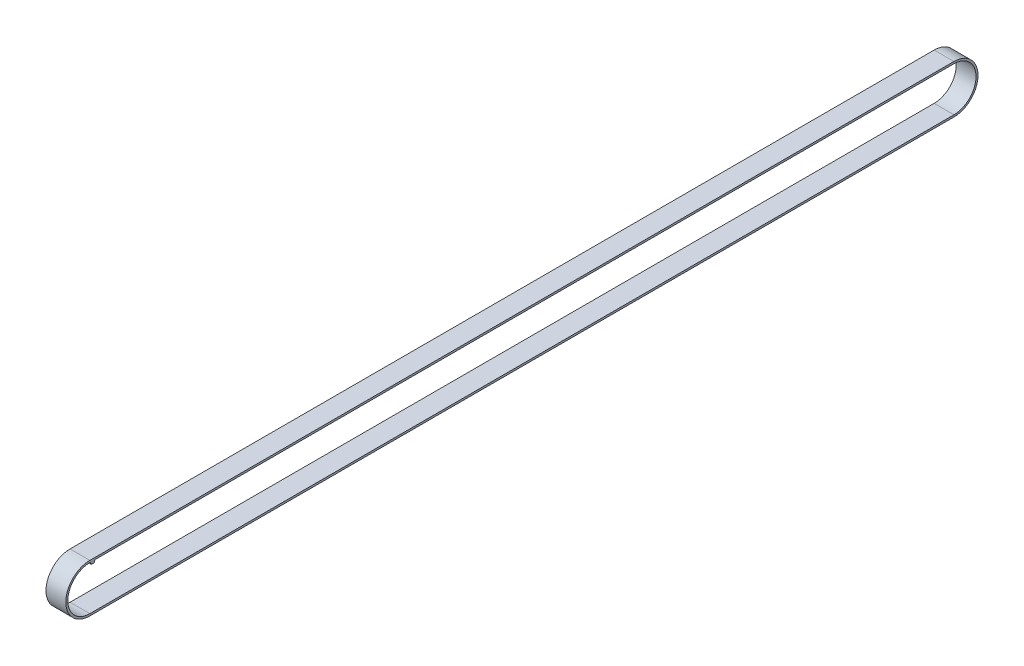
ISO-10303-21;
HEADER;
FILE_DESCRIPTION(('STEP AP214'),'2;1');
FILE_NAME('part.step','',(''),(''),'','','');
FILE_SCHEMA(('AUTOMOTIVE_DESIGN { 1 0 10303 214 1 1 1 1 }'));
ENDSEC;
DATA;
#1=APPLICATION_CONTEXT('core data for automotive mechanical design processes');
#2=APPLICATION_PROTOCOL_DEFINITION('international standard','automotive_design',2000,#1);
#3=PRODUCT_CONTEXT('',#1,'mechanical');
#4=PRODUCT('Part','Part','',(#3));
#5=PRODUCT_RELATED_PRODUCT_CATEGORY('part','',(#4));
#6=PRODUCT_DEFINITION_FORMATION('','',#4);
#7=PRODUCT_DEFINITION_CONTEXT('part definition',#1,'design');
#8=PRODUCT_DEFINITION('design','',#6,#7);
#9=PRODUCT_DEFINITION_SHAPE('','',#8);
#10=(LENGTH_UNIT() NAMED_UNIT(*) SI_UNIT(.MILLI.,.METRE.));
#11=(NAMED_UNIT(*) PLANE_ANGLE_UNIT() SI_UNIT($,.RADIAN.));
#12=(NAMED_UNIT(*) SI_UNIT($,.STERADIAN.) SOLID_ANGLE_UNIT());
#13=UNCERTAINTY_MEASURE_WITH_UNIT(LENGTH_MEASURE(1.E-05),#10,'distance_accuracy_value','');
#14=(GEOMETRIC_REPRESENTATION_CONTEXT(3) GLOBAL_UNCERTAINTY_ASSIGNED_CONTEXT((#13)) GLOBAL_UNIT_ASSIGNED_CONTEXT((#10,
#11,#12)) REPRESENTATION_CONTEXT('',''));
#15=CARTESIAN_POINT('',(0.,0.,0.));
#16=DIRECTION('',(0.,0.,1.));
#17=DIRECTION('',(1.,0.,0.));
#18=AXIS2_PLACEMENT_3D('',#15,#16,#17);
#19=CARTESIAN_POINT('',(6.,6.7,0.));
#20=DIRECTION('',(0.,-1.,0.));
#21=DIRECTION('',(0.,0.,-1.));
#22=AXIS2_PLACEMENT_3D('',#19,#20,#21);
#23=PLANE('',#22);
#24=DIRECTION('',(0.,0.,1.));
#25=VECTOR('',#24,1.);
#26=CARTESIAN_POINT('',(6.,6.7,0.));
#27=LINE('',#26,#25);
#28=CARTESIAN_POINT('',(6.,6.7,-262.));
#29=VERTEX_POINT('',#28);
#30=CARTESIAN_POINT('',(6.,6.7,-1.69384731022608));
#31=VERTEX_POINT('',#30);
#32=EDGE_CURVE('E185',#29,#31,#27,.T.);
#33=ORIENTED_EDGE('',*,*,#32,.T.);
#34=DIRECTION('',(-1.,0.,0.));
#35=VECTOR('',#34,1.);
#36=CARTESIAN_POINT('',(6.,6.7,-1.69384731022608));
#37=LINE('',#36,#35);
#38=CARTESIAN_POINT('',(0.,6.7,-1.69384731022608));
#39=VERTEX_POINT('',#38);
#40=EDGE_CURVE('E423',#31,#39,#37,.T.);
#41=ORIENTED_EDGE('',*,*,#40,.T.);
#42=DIRECTION('',(0.,0.,1.));
#43=VECTOR('',#42,1.);
#44=CARTESIAN_POINT('',(0.,6.7,0.));
#45=LINE('',#44,#43);
#46=CARTESIAN_POINT('',(0.,6.7,-262.));
#47=VERTEX_POINT('',#46);
#48=EDGE_CURVE('E181',#47,#39,#45,.T.);
#49=ORIENTED_EDGE('',*,*,#48,.F.);
#50=DIRECTION('',(-1.,0.,0.));
#51=VECTOR('',#50,1.);
#52=CARTESIAN_POINT('',(6.,6.7,-262.));
#53=LINE('',#52,#51);
#54=EDGE_CURVE('E50',#29,#47,#53,.T.);
#55=ORIENTED_EDGE('',*,*,#54,.F.);
#56=EDGE_LOOP('',(#33,#41,#49,#55));
#57=FACE_BOUND('',#56,.T.);
#58=ADVANCED_FACE('F35',(#57),#23,.T.);
#59=CARTESIAN_POINT('',(6.,0.,0.));
#60=DIRECTION('',(1.,0.,0.));
#61=DIRECTION('',(0.,0.,-1.));
#62=AXIS2_PLACEMENT_3D('',#59,#60,#61);
#63=PLANE('',#62);
#64=CARTESIAN_POINT('',(6.,0.,0.));
#65=DIRECTION('',(1.,0.,0.));
#66=DIRECTION('',(0.,0.,-1.));
#67=AXIS2_PLACEMENT_3D('',#64,#65,#66);
#68=CIRCLE('',#67,7.3);
#69=CARTESIAN_POINT('',(6.,7.3,0.));
#70=VERTEX_POINT('',#69);
#71=CARTESIAN_POINT('',(6.,-7.3,0.));
#72=VERTEX_POINT('',#71);
#73=EDGE_CURVE('E203',#70,#72,#68,.T.);
#74=ORIENTED_EDGE('',*,*,#73,.T.);
#75=DIRECTION('',(0.,0.,-1.));
#76=VECTOR('',#75,1.);
#77=CARTESIAN_POINT('',(6.,-7.3,0.));
#78=LINE('',#77,#76);
#79=CARTESIAN_POINT('',(6.,-7.3,-262.));
#80=VERTEX_POINT('',#79);
#81=EDGE_CURVE('E206',#72,#80,#78,.T.);
#82=ORIENTED_EDGE('',*,*,#81,.T.);
#83=CARTESIAN_POINT('',(6.,0.,-262.));
#84=DIRECTION('',(1.,0.,0.));
#85=DIRECTION('',(0.,0.,-1.));
#86=AXIS2_PLACEMENT_3D('',#83,#84,#85);
#87=CIRCLE('',#86,7.3);
#88=CARTESIAN_POINT('',(6.,7.3,-262.));
#89=VERTEX_POINT('',#88);
#90=EDGE_CURVE('E209',#80,#89,#87,.T.);
#91=ORIENTED_EDGE('',*,*,#90,.T.);
#92=DIRECTION('',(0.,0.,1.));
#93=VECTOR('',#92,1.);
#94=CARTESIAN_POINT('',(6.,7.3,0.));
#95=LINE('',#94,#93);
#96=EDGE_CURVE('E211',#89,#70,#95,.T.);
#97=ORIENTED_EDGE('',*,*,#96,.T.);
#98=EDGE_LOOP('',(#74,#82,#91,#97));
#99=FACE_BOUND('',#98,.T.);
#100=DIRECTION('',(0.,0.,-1.));
#101=VECTOR('',#100,1.);
#102=CARTESIAN_POINT('',(6.,-6.7,0.));
#103=LINE('',#102,#101);
#104=CARTESIAN_POINT('',(6.,-6.7,0.));
#105=VERTEX_POINT('',#104);
#106=CARTESIAN_POINT('',(6.,-6.7,-262.));
#107=VERTEX_POINT('',#106);
#108=EDGE_CURVE('E180',#105,#107,#103,.T.);
#109=ORIENTED_EDGE('',*,*,#108,.F.);
#110=CARTESIAN_POINT('',(6.,0.,0.));
#111=DIRECTION('',(1.,0.,0.));
#112=DIRECTION('',(0.,0.,-1.));
#113=AXIS2_PLACEMENT_3D('',#110,#111,#112);
#114=CIRCLE('',#113,6.7);
#115=CARTESIAN_POINT('',(6.,6.7,0.));
#116=VERTEX_POINT('',#115);
#117=EDGE_CURVE('E178',#116,#105,#114,.T.);
#118=ORIENTED_EDGE('',*,*,#117,.F.);
#119=CARTESIAN_POINT('',(6.,6.5,0.));
#120=DIRECTION('',(-1.,0.,0.));
#121=DIRECTION('',(0.,0.,-1.));
#122=AXIS2_PLACEMENT_3D('',#119,#120,#121);
#123=CIRCLE('',#122,0.200000000000001);
#124=CARTESIAN_POINT('',(6.,6.56840402866513,-0.187938524157182));
#125=VERTEX_POINT('',#124);
#126=EDGE_CURVE('E440',#116,#125,#123,.T.);
#127=ORIENTED_EDGE('',*,*,#126,.T.);
#128=DIRECTION('',(0.,-0.939692620785909,-0.342020143325667));
#129=VECTOR('',#128,1.);
#130=CARTESIAN_POINT('',(6.,6.56840402866513,-0.187938524157182));
#131=LINE('',#130,#129);
#132=CARTESIAN_POINT('',(6.,6.13159597133487,-0.346923655113042));
#133=VERTEX_POINT('',#132);
#134=EDGE_CURVE('E161',#125,#133,#131,.T.);
#135=ORIENTED_EDGE('',*,*,#134,.T.);
#136=CARTESIAN_POINT('',(6.,6.2,-0.534862179270224));
#137=DIRECTION('',(1.,0.,0.));
#138=DIRECTION('',(0.,0.,-1.));
#139=AXIS2_PLACEMENT_3D('',#136,#137,#138);
#140=CIRCLE('',#139,0.2);
#141=CARTESIAN_POINT('',(6.,6.,-0.534862179270224));
#142=VERTEX_POINT('',#141);
#143=EDGE_CURVE('E155',#133,#142,#140,.T.);
#144=ORIENTED_EDGE('',*,*,#143,.T.);
#145=DIRECTION('',(0.,0.,-1.));
#146=VECTOR('',#145,1.);
#147=CARTESIAN_POINT('',(6.,6.,-0.534862179270224));
#148=LINE('',#147,#146);
#149=CARTESIAN_POINT('',(6.,6.,-1.15898513095586));
#150=VERTEX_POINT('',#149);
#151=EDGE_CURVE('E144',#142,#150,#148,.T.);
#152=ORIENTED_EDGE('',*,*,#151,.T.);
#153=CARTESIAN_POINT('',(6.,6.2,-1.15898513095586));
#154=DIRECTION('',(1.,0.,0.));
#155=DIRECTION('',(0.,0.,-1.));
#156=AXIS2_PLACEMENT_3D('',#153,#154,#155);
#157=CIRCLE('',#156,0.2);
#158=CARTESIAN_POINT('',(6.,6.13159597133487,-1.34692365511304));
#159=VERTEX_POINT('',#158);
#160=EDGE_CURVE('E154',#150,#159,#157,.T.);
#161=ORIENTED_EDGE('',*,*,#160,.T.);
#162=DIRECTION('',(0.,0.939692620785909,-0.342020143325668));
#163=VECTOR('',#162,1.);
#164=CARTESIAN_POINT('',(6.,6.13159597133487,-1.34692365511304));
#165=LINE('',#164,#163);
#166=CARTESIAN_POINT('',(6.,6.56840402866513,-1.5059087860689));
#167=VERTEX_POINT('',#166);
#168=EDGE_CURVE('E433',#159,#167,#165,.T.);
#169=ORIENTED_EDGE('',*,*,#168,.T.);
#170=CARTESIAN_POINT('',(6.,6.5,-1.69384731022608));
#171=DIRECTION('',(-1.,0.,0.));
#172=DIRECTION('',(0.,0.,1.));
#173=AXIS2_PLACEMENT_3D('',#170,#171,#172);
#174=CIRCLE('',#173,0.200000000000001);
#175=EDGE_CURVE('E439',#167,#31,#174,.T.);
#176=ORIENTED_EDGE('',*,*,#175,.T.);
#177=ORIENTED_EDGE('',*,*,#32,.F.);
#178=CARTESIAN_POINT('',(6.,0.,-262.));
#179=DIRECTION('',(1.,0.,0.));
#180=DIRECTION('',(0.,0.,-1.));
#181=AXIS2_PLACEMENT_3D('',#178,#179,#180);
#182=CIRCLE('',#181,6.7);
#183=EDGE_CURVE('E183',#107,#29,#182,.T.);
#184=ORIENTED_EDGE('',*,*,#183,.F.);
#185=EDGE_LOOP('',(#109,#118,#127,#135,#144,#152,#161,#169,#176,#177,#184));
#186=FACE_BOUND('',#185,.T.);
#187=ADVANCED_FACE('F159',(#99,#186),#63,.T.);
#188=CARTESIAN_POINT('',(0.,0.,0.));
#189=DIRECTION('',(1.,0.,0.));
#190=DIRECTION('',(0.,0.,-1.));
#191=AXIS2_PLACEMENT_3D('',#188,#189,#190);
#192=PLANE('',#191);
#193=CARTESIAN_POINT('',(0.,0.,0.));
#194=DIRECTION('',(1.,0.,0.));
#195=DIRECTION('',(0.,0.,-1.));
#196=AXIS2_PLACEMENT_3D('',#193,#194,#195);
#197=CIRCLE('',#196,7.3);
#198=CARTESIAN_POINT('',(0.,7.3,0.));
#199=VERTEX_POINT('',#198);
#200=CARTESIAN_POINT('',(0.,-7.3,0.));
#201=VERTEX_POINT('',#200);
#202=EDGE_CURVE('E202',#199,#201,#197,.T.);
#203=ORIENTED_EDGE('',*,*,#202,.F.);
#204=DIRECTION('',(0.,0.,1.));
#205=VECTOR('',#204,1.);
#206=CARTESIAN_POINT('',(0.,7.3,0.));
#207=LINE('',#206,#205);
#208=CARTESIAN_POINT('',(0.,7.3,-262.));
#209=VERTEX_POINT('',#208);
#210=EDGE_CURVE('E207',#209,#199,#207,.T.);
#211=ORIENTED_EDGE('',*,*,#210,.F.);
#212=CARTESIAN_POINT('',(0.,0.,-262.));
#213=DIRECTION('',(1.,0.,0.));
#214=DIRECTION('',(0.,0.,-1.));
#215=AXIS2_PLACEMENT_3D('',#212,#213,#214);
#216=CIRCLE('',#215,7.3);
#217=CARTESIAN_POINT('',(0.,-7.3,-262.));
#218=VERTEX_POINT('',#217);
#219=EDGE_CURVE('E218',#218,#209,#216,.T.);
#220=ORIENTED_EDGE('',*,*,#219,.F.);
#221=DIRECTION('',(0.,0.,-1.));
#222=VECTOR('',#221,1.);
#223=CARTESIAN_POINT('',(0.,-7.3,0.));
#224=LINE('',#223,#222);
#225=EDGE_CURVE('E216',#201,#218,#224,.T.);
#226=ORIENTED_EDGE('',*,*,#225,.F.);
#227=EDGE_LOOP('',(#203,#211,#220,#226));
#228=FACE_BOUND('',#227,.T.);
#229=CARTESIAN_POINT('',(0.,0.,0.));
#230=DIRECTION('',(1.,0.,0.));
#231=DIRECTION('',(0.,0.,-1.));
#232=AXIS2_PLACEMENT_3D('',#229,#230,#231);
#233=CIRCLE('',#232,6.7);
#234=CARTESIAN_POINT('',(0.,6.7,0.));
#235=VERTEX_POINT('',#234);
#236=CARTESIAN_POINT('',(0.,-6.7,0.));
#237=VERTEX_POINT('',#236);
#238=EDGE_CURVE('E170',#235,#237,#233,.T.);
#239=ORIENTED_EDGE('',*,*,#238,.T.);
#240=DIRECTION('',(0.,0.,-1.));
#241=VECTOR('',#240,1.);
#242=CARTESIAN_POINT('',(0.,-6.7,0.));
#243=LINE('',#242,#241);
#244=CARTESIAN_POINT('',(0.,-6.7,-262.));
#245=VERTEX_POINT('',#244);
#246=EDGE_CURVE('E172',#237,#245,#243,.T.);
#247=ORIENTED_EDGE('',*,*,#246,.T.);
#248=CARTESIAN_POINT('',(0.,0.,-262.));
#249=DIRECTION('',(1.,0.,0.));
#250=DIRECTION('',(0.,0.,-1.));
#251=AXIS2_PLACEMENT_3D('',#248,#249,#250);
#252=CIRCLE('',#251,6.7);
#253=EDGE_CURVE('E190',#245,#47,#252,.T.);
#254=ORIENTED_EDGE('',*,*,#253,.T.);
#255=ORIENTED_EDGE('',*,*,#48,.T.);
#256=CARTESIAN_POINT('',(0.,6.5,-1.69384731022608));
#257=DIRECTION('',(-1.,0.,0.));
#258=DIRECTION('',(0.,0.,1.));
#259=AXIS2_PLACEMENT_3D('',#256,#257,#258);
#260=CIRCLE('',#259,0.200000000000001);
#261=CARTESIAN_POINT('',(0.,6.56840402866513,-1.5059087860689));
#262=VERTEX_POINT('',#261);
#263=EDGE_CURVE('E419',#262,#39,#260,.T.);
#264=ORIENTED_EDGE('',*,*,#263,.F.);
#265=DIRECTION('',(0.,0.939692620785909,-0.342020143325668));
#266=VECTOR('',#265,1.);
#267=CARTESIAN_POINT('',(0.,6.13159597133487,-1.34692365511304));
#268=LINE('',#267,#266);
#269=CARTESIAN_POINT('',(0.,6.13159597133487,-1.34692365511304));
#270=VERTEX_POINT('',#269);
#271=EDGE_CURVE('E417',#270,#262,#268,.T.);
#272=ORIENTED_EDGE('',*,*,#271,.F.);
#273=CARTESIAN_POINT('',(0.,6.2,-1.15898513095586));
#274=DIRECTION('',(1.,0.,0.));
#275=DIRECTION('',(0.,0.,-1.));
#276=AXIS2_PLACEMENT_3D('',#273,#274,#275);
#277=CIRCLE('',#276,0.2);
#278=CARTESIAN_POINT('',(0.,6.,-1.15898513095586));
#279=VERTEX_POINT('',#278);
#280=EDGE_CURVE('E411',#279,#270,#277,.T.);
#281=ORIENTED_EDGE('',*,*,#280,.F.);
#282=DIRECTION('',(0.,0.,-1.));
#283=VECTOR('',#282,1.);
#284=CARTESIAN_POINT('',(0.,6.,-0.534862179270224));
#285=LINE('',#284,#283);
#286=CARTESIAN_POINT('',(0.,6.,-0.534862179270224));
#287=VERTEX_POINT('',#286);
#288=EDGE_CURVE('E409',#287,#279,#285,.T.);
#289=ORIENTED_EDGE('',*,*,#288,.F.);
#290=CARTESIAN_POINT('',(0.,6.2,-0.534862179270224));
#291=DIRECTION('',(1.,0.,0.));
#292=DIRECTION('',(0.,0.,-1.));
#293=AXIS2_PLACEMENT_3D('',#290,#291,#292);
#294=CIRCLE('',#293,0.2);
#295=CARTESIAN_POINT('',(0.,6.13159597133487,-0.346923655113042));
#296=VERTEX_POINT('',#295);
#297=EDGE_CURVE('E169',#296,#287,#294,.T.);
#298=ORIENTED_EDGE('',*,*,#297,.F.);
#299=DIRECTION('',(0.,-0.939692620785909,-0.342020143325667));
#300=VECTOR('',#299,1.);
#301=CARTESIAN_POINT('',(0.,6.56840402866513,-0.187938524157182));
#302=LINE('',#301,#300);
#303=CARTESIAN_POINT('',(0.,6.56840402866513,-0.187938524157182));
#304=VERTEX_POINT('',#303);
#305=EDGE_CURVE('E165',#304,#296,#302,.T.);
#306=ORIENTED_EDGE('',*,*,#305,.F.);
#307=CARTESIAN_POINT('',(0.,6.5,0.));
#308=DIRECTION('',(-1.,0.,0.));
#309=DIRECTION('',(0.,0.,-1.));
#310=AXIS2_PLACEMENT_3D('',#307,#308,#309);
#311=CIRCLE('',#310,0.200000000000001);
#312=EDGE_CURVE('E58',#235,#304,#311,.T.);
#313=ORIENTED_EDGE('',*,*,#312,.F.);
#314=EDGE_LOOP('',(#239,#247,#254,#255,#264,#272,#281,#289,#298,#306,#313));
#315=FACE_BOUND('',#314,.T.);
#316=ADVANCED_FACE('F236',(#228,#315),#192,.F.);
#317=CARTESIAN_POINT('',(6.,0.,0.));
#318=DIRECTION('',(-1.,0.,0.));
#319=DIRECTION('',(0.,0.,1.));
#320=AXIS2_PLACEMENT_3D('',#317,#318,#319);
#321=CYLINDRICAL_SURFACE('',#320,7.3);
#322=ORIENTED_EDGE('',*,*,#202,.T.);
#323=DIRECTION('',(-1.,0.,0.));
#324=VECTOR('',#323,1.);
#325=CARTESIAN_POINT('',(6.,-7.3,0.));
#326=LINE('',#325,#324);
#327=EDGE_CURVE('E11',#72,#201,#326,.T.);
#328=ORIENTED_EDGE('',*,*,#327,.F.);
#329=ORIENTED_EDGE('',*,*,#73,.F.);
#330=DIRECTION('',(-1.,0.,0.));
#331=VECTOR('',#330,1.);
#332=CARTESIAN_POINT('',(6.,7.3,0.));
#333=LINE('',#332,#331);
#334=EDGE_CURVE('E213',#70,#199,#333,.T.);
#335=ORIENTED_EDGE('',*,*,#334,.T.);
#336=EDGE_LOOP('',(#322,#328,#329,#335));
#337=FACE_BOUND('',#336,.T.);
#338=ADVANCED_FACE('F37',(#337),#321,.T.);
#339=CARTESIAN_POINT('',(6.,-7.3,0.));
#340=DIRECTION('',(0.,1.,0.));
#341=DIRECTION('',(0.,0.,1.));
#342=AXIS2_PLACEMENT_3D('',#339,#340,#341);
#343=PLANE('',#342);
#344=ORIENTED_EDGE('',*,*,#225,.T.);
#345=DIRECTION('',(-1.,0.,0.));
#346=VECTOR('',#345,1.);
#347=CARTESIAN_POINT('',(6.,-7.3,-262.));
#348=LINE('',#347,#346);
#349=EDGE_CURVE('E43',#80,#218,#348,.T.);
#350=ORIENTED_EDGE('',*,*,#349,.F.);
#351=ORIENTED_EDGE('',*,*,#81,.F.);
#352=ORIENTED_EDGE('',*,*,#327,.T.);
#353=EDGE_LOOP('',(#344,#350,#351,#352));
#354=FACE_BOUND('',#353,.T.);
#355=ADVANCED_FACE('F245',(#354),#343,.F.);
#356=CARTESIAN_POINT('',(6.,0.,-262.));
#357=DIRECTION('',(-1.,0.,0.));
#358=DIRECTION('',(0.,0.,1.));
#359=AXIS2_PLACEMENT_3D('',#356,#357,#358);
#360=CYLINDRICAL_SURFACE('',#359,7.3);
#361=ORIENTED_EDGE('',*,*,#219,.T.);
#362=DIRECTION('',(-1.,0.,0.));
#363=VECTOR('',#362,1.);
#364=CARTESIAN_POINT('',(6.,7.3,-262.));
#365=LINE('',#364,#363);
#366=EDGE_CURVE('E223',#89,#209,#365,.T.);
#367=ORIENTED_EDGE('',*,*,#366,.F.);
#368=ORIENTED_EDGE('',*,*,#90,.F.);
#369=ORIENTED_EDGE('',*,*,#349,.T.);
#370=EDGE_LOOP('',(#361,#367,#368,#369));
#371=FACE_BOUND('',#370,.T.);
#372=ADVANCED_FACE('F230',(#371),#360,.T.);
#373=CARTESIAN_POINT('',(6.,7.3,0.));
#374=DIRECTION('',(0.,-1.,0.));
#375=DIRECTION('',(0.,0.,-1.));
#376=AXIS2_PLACEMENT_3D('',#373,#374,#375);
#377=PLANE('',#376);
#378=ORIENTED_EDGE('',*,*,#210,.T.);
#379=ORIENTED_EDGE('',*,*,#334,.F.);
#380=ORIENTED_EDGE('',*,*,#96,.F.);
#381=ORIENTED_EDGE('',*,*,#366,.T.);
#382=EDGE_LOOP('',(#378,#379,#380,#381));
#383=FACE_BOUND('',#382,.T.);
#384=ADVANCED_FACE('F239',(#383),#377,.F.);
#385=CARTESIAN_POINT('',(6.,0.,0.));
#386=DIRECTION('',(-1.,0.,0.));
#387=DIRECTION('',(0.,0.,1.));
#388=AXIS2_PLACEMENT_3D('',#385,#386,#387);
#389=CYLINDRICAL_SURFACE('',#388,6.7);
#390=ORIENTED_EDGE('',*,*,#238,.F.);
#391=DIRECTION('',(-1.,0.,0.));
#392=VECTOR('',#391,1.);
#393=CARTESIAN_POINT('',(6.,6.7,0.));
#394=LINE('',#393,#392);
#395=EDGE_CURVE('E186',#116,#235,#394,.T.);
#396=ORIENTED_EDGE('',*,*,#395,.F.);
#397=ORIENTED_EDGE('',*,*,#117,.T.);
#398=DIRECTION('',(-1.,0.,0.));
#399=VECTOR('',#398,1.);
#400=CARTESIAN_POINT('',(6.,-6.7,0.));
#401=LINE('',#400,#399);
#402=EDGE_CURVE('E199',#105,#237,#401,.T.);
#403=ORIENTED_EDGE('',*,*,#402,.T.);
#404=EDGE_LOOP('',(#390,#396,#397,#403));
#405=FACE_BOUND('',#404,.T.);
#406=ADVANCED_FACE('F268',(#405),#389,.F.);
#407=CARTESIAN_POINT('',(6.,-6.7,0.));
#408=DIRECTION('',(0.,1.,0.));
#409=DIRECTION('',(0.,0.,1.));
#410=AXIS2_PLACEMENT_3D('',#407,#408,#409);
#411=PLANE('',#410);
#412=ORIENTED_EDGE('',*,*,#246,.F.);
#413=ORIENTED_EDGE('',*,*,#402,.F.);
#414=ORIENTED_EDGE('',*,*,#108,.T.);
#415=DIRECTION('',(-1.,0.,0.));
#416=VECTOR('',#415,1.);
#417=CARTESIAN_POINT('',(6.,-6.7,-262.));
#418=LINE('',#417,#416);
#419=EDGE_CURVE('E197',#107,#245,#418,.T.);
#420=ORIENTED_EDGE('',*,*,#419,.T.);
#421=EDGE_LOOP('',(#412,#413,#414,#420));
#422=FACE_BOUND('',#421,.T.);
#423=ADVANCED_FACE('F264',(#422),#411,.T.);
#424=CARTESIAN_POINT('',(6.,0.,-262.));
#425=DIRECTION('',(-1.,0.,0.));
#426=DIRECTION('',(0.,0.,1.));
#427=AXIS2_PLACEMENT_3D('',#424,#425,#426);
#428=CYLINDRICAL_SURFACE('',#427,6.7);
#429=ORIENTED_EDGE('',*,*,#253,.F.);
#430=ORIENTED_EDGE('',*,*,#419,.F.);
#431=ORIENTED_EDGE('',*,*,#183,.T.);
#432=ORIENTED_EDGE('',*,*,#54,.T.);
#433=EDGE_LOOP('',(#429,#430,#431,#432));
#434=FACE_BOUND('',#433,.T.);
#435=ADVANCED_FACE('F261',(#434),#428,.F.);
#436=CARTESIAN_POINT('',(6.,6.2,-0.534862179270224));
#437=DIRECTION('',(-1.,0.,0.));
#438=DIRECTION('',(0.,0.,1.));
#439=AXIS2_PLACEMENT_3D('',#436,#437,#438);
#440=CYLINDRICAL_SURFACE('',#439,0.2);
#441=ORIENTED_EDGE('',*,*,#297,.T.);
#442=DIRECTION('',(-1.,0.,0.));
#443=VECTOR('',#442,1.);
#444=CARTESIAN_POINT('',(6.,6.,-0.534862179270224));
#445=LINE('',#444,#443);
#446=EDGE_CURVE('E148',#142,#287,#445,.T.);
#447=ORIENTED_EDGE('',*,*,#446,.F.);
#448=ORIENTED_EDGE('',*,*,#143,.F.);
#449=DIRECTION('',(-1.,0.,0.));
#450=VECTOR('',#449,1.);
#451=CARTESIAN_POINT('',(6.,6.13159597133487,-0.346923655113042));
#452=LINE('',#451,#450);
#453=EDGE_CURVE('E403',#133,#296,#452,.T.);
#454=ORIENTED_EDGE('',*,*,#453,.T.);
#455=EDGE_LOOP('',(#441,#447,#448,#454));
#456=FACE_BOUND('',#455,.T.);
#457=ADVANCED_FACE('F167',(#456),#440,.T.);
#458=CARTESIAN_POINT('',(6.,6.,-0.534862179270224));
#459=DIRECTION('',(0.,1.,0.));
#460=DIRECTION('',(0.,0.,1.));
#461=AXIS2_PLACEMENT_3D('',#458,#459,#460);
#462=PLANE('',#461);
#463=ORIENTED_EDGE('',*,*,#288,.T.);
#464=DIRECTION('',(-1.,0.,0.));
#465=VECTOR('',#464,1.);
#466=CARTESIAN_POINT('',(6.,6.,-1.15898513095586));
#467=LINE('',#466,#465);
#468=EDGE_CURVE('E151',#150,#279,#467,.T.);
#469=ORIENTED_EDGE('',*,*,#468,.F.);
#470=ORIENTED_EDGE('',*,*,#151,.F.);
#471=ORIENTED_EDGE('',*,*,#446,.T.);
#472=EDGE_LOOP('',(#463,#469,#470,#471));
#473=FACE_BOUND('',#472,.T.);
#474=ADVANCED_FACE('F146',(#473),#462,.F.);
#475=CARTESIAN_POINT('',(6.,6.2,-1.15898513095586));
#476=DIRECTION('',(-1.,0.,0.));
#477=DIRECTION('',(0.,0.,1.));
#478=AXIS2_PLACEMENT_3D('',#475,#476,#477);
#479=CYLINDRICAL_SURFACE('',#478,0.2);
#480=ORIENTED_EDGE('',*,*,#280,.T.);
#481=DIRECTION('',(-1.,0.,0.));
#482=VECTOR('',#481,1.);
#483=CARTESIAN_POINT('',(6.,6.13159597133487,-1.34692365511304));
#484=LINE('',#483,#482);
#485=EDGE_CURVE('E174',#159,#270,#484,.T.);
#486=ORIENTED_EDGE('',*,*,#485,.F.);
#487=ORIENTED_EDGE('',*,*,#160,.F.);
#488=ORIENTED_EDGE('',*,*,#468,.T.);
#489=EDGE_LOOP('',(#480,#486,#487,#488));
#490=FACE_BOUND('',#489,.T.);
#491=ADVANCED_FACE('F304',(#490),#479,.T.);
#492=CARTESIAN_POINT('',(6.,6.13159597133487,-1.34692365511304));
#493=DIRECTION('',(0.,0.342020143325668,0.939692620785909));
#494=DIRECTION('',(0.,-0.939692620785909,0.342020143325668));
#495=AXIS2_PLACEMENT_3D('',#492,#493,#494);
#496=PLANE('',#495);
#497=ORIENTED_EDGE('',*,*,#271,.T.);
#498=DIRECTION('',(-1.,0.,0.));
#499=VECTOR('',#498,1.);
#500=CARTESIAN_POINT('',(6.,6.56840402866513,-1.5059087860689));
#501=LINE('',#500,#499);
#502=EDGE_CURVE('E426',#167,#262,#501,.T.);
#503=ORIENTED_EDGE('',*,*,#502,.F.);
#504=ORIENTED_EDGE('',*,*,#168,.F.);
#505=ORIENTED_EDGE('',*,*,#485,.T.);
#506=EDGE_LOOP('',(#497,#503,#504,#505));
#507=FACE_BOUND('',#506,.T.);
#508=ADVANCED_FACE('F310',(#507),#496,.F.);
#509=CARTESIAN_POINT('',(6.,6.5,-1.69384731022608));
#510=DIRECTION('',(-1.,0.,0.));
#511=DIRECTION('',(0.,0.,1.));
#512=AXIS2_PLACEMENT_3D('',#509,#510,#511);
#513=CYLINDRICAL_SURFACE('',#512,0.200000000000001);
#514=ORIENTED_EDGE('',*,*,#263,.T.);
#515=ORIENTED_EDGE('',*,*,#40,.F.);
#516=ORIENTED_EDGE('',*,*,#175,.F.);
#517=ORIENTED_EDGE('',*,*,#502,.T.);
#518=EDGE_LOOP('',(#514,#515,#516,#517));
#519=FACE_BOUND('',#518,.T.);
#520=ADVANCED_FACE('F318',(#519),#513,.F.);
#521=CARTESIAN_POINT('',(6.,6.5,0.));
#522=DIRECTION('',(-1.,0.,0.));
#523=DIRECTION('',(0.,0.,1.));
#524=AXIS2_PLACEMENT_3D('',#521,#522,#523);
#525=CYLINDRICAL_SURFACE('',#524,0.200000000000001);
#526=ORIENTED_EDGE('',*,*,#312,.T.);
#527=DIRECTION('',(-1.,0.,0.));
#528=VECTOR('',#527,1.);
#529=CARTESIAN_POINT('',(6.,6.56840402866513,-0.187938524157182));
#530=LINE('',#529,#528);
#531=EDGE_CURVE('E405',#125,#304,#530,.T.);
#532=ORIENTED_EDGE('',*,*,#531,.F.);
#533=ORIENTED_EDGE('',*,*,#126,.F.);
#534=ORIENTED_EDGE('',*,*,#395,.T.);
#535=EDGE_LOOP('',(#526,#532,#533,#534));
#536=FACE_BOUND('',#535,.T.);
#537=ADVANCED_FACE('F326',(#536),#525,.F.);
#538=CARTESIAN_POINT('',(6.,6.56840402866513,-0.187938524157182));
#539=DIRECTION('',(0.,0.342020143325667,-0.939692620785909));
#540=DIRECTION('',(0.,0.939692620785909,0.342020143325667));
#541=AXIS2_PLACEMENT_3D('',#538,#539,#540);
#542=PLANE('',#541);
#543=ORIENTED_EDGE('',*,*,#305,.T.);
#544=ORIENTED_EDGE('',*,*,#453,.F.);
#545=ORIENTED_EDGE('',*,*,#134,.F.);
#546=ORIENTED_EDGE('',*,*,#531,.T.);
#547=EDGE_LOOP('',(#543,#544,#545,#546));
#548=FACE_BOUND('',#547,.T.);
#549=ADVANCED_FACE('F334',(#548),#542,.F.);
#550=CLOSED_SHELL('',(#58,#187,#316,#338,#355,#372,#384,#406,#423,#435,#457,#474,#491,#508,#520,
#537,#549));
#551=MANIFOLD_SOLID_BREP('B2',#550);
#552=ADVANCED_BREP_SHAPE_REPRESENTATION('',(#18,#551),#14);
#553=SHAPE_DEFINITION_REPRESENTATION(#9,#552);
ENDSEC;
END-ISO-10303-21;
